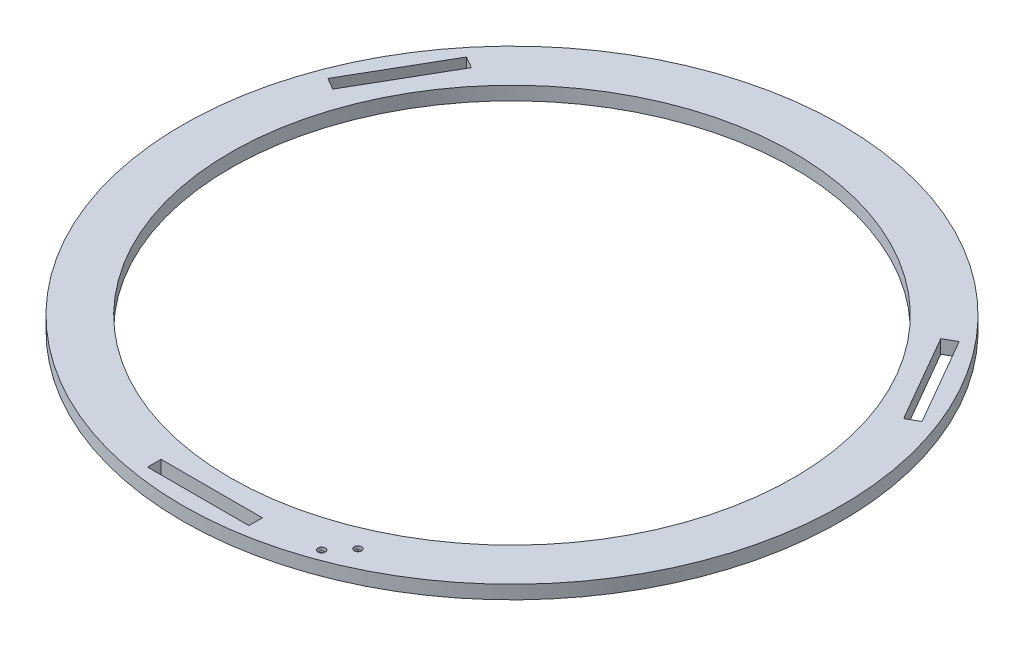
ISO-10303-21;
HEADER;
FILE_DESCRIPTION(('STEP AP214'),'2;1');
FILE_NAME('part.step','',(''),(''),'','','');
FILE_SCHEMA(('AUTOMOTIVE_DESIGN { 1 0 10303 214 1 1 1 1 }'));
ENDSEC;
DATA;
#1=APPLICATION_CONTEXT('core data for automotive mechanical design processes');
#2=APPLICATION_PROTOCOL_DEFINITION('international standard','automotive_design',2000,#1);
#3=PRODUCT_CONTEXT('',#1,'mechanical');
#4=PRODUCT('Part','Part','',(#3));
#5=PRODUCT_RELATED_PRODUCT_CATEGORY('part','',(#4));
#6=PRODUCT_DEFINITION_FORMATION('','',#4);
#7=PRODUCT_DEFINITION_CONTEXT('part definition',#1,'design');
#8=PRODUCT_DEFINITION('design','',#6,#7);
#9=PRODUCT_DEFINITION_SHAPE('','',#8);
#10=(LENGTH_UNIT() NAMED_UNIT(*) SI_UNIT(.MILLI.,.METRE.));
#11=(NAMED_UNIT(*) PLANE_ANGLE_UNIT() SI_UNIT($,.RADIAN.));
#12=(NAMED_UNIT(*) SI_UNIT($,.STERADIAN.) SOLID_ANGLE_UNIT());
#13=UNCERTAINTY_MEASURE_WITH_UNIT(LENGTH_MEASURE(1.E-05),#10,'distance_accuracy_value','');
#14=(GEOMETRIC_REPRESENTATION_CONTEXT(3) GLOBAL_UNCERTAINTY_ASSIGNED_CONTEXT((#13)) GLOBAL_UNIT_ASSIGNED_CONTEXT((#10,
#11,#12)) REPRESENTATION_CONTEXT('',''));
#15=CARTESIAN_POINT('',(0.,0.,0.));
#16=DIRECTION('',(0.,0.,1.));
#17=DIRECTION('',(1.,0.,0.));
#18=AXIS2_PLACEMENT_3D('',#15,#16,#17);
#19=CARTESIAN_POINT('',(0.,12.,0.));
#20=DIRECTION('',(0.,1.,0.));
#21=DIRECTION('',(0.,0.,1.));
#22=AXIS2_PLACEMENT_3D('',#19,#20,#21);
#23=PLANE('',#22);
#24=CARTESIAN_POINT('',(111.175516554323,12.,247.940494387325));
#25=DIRECTION('',(0.,1.,0.));
#26=DIRECTION('',(0.,0.,1.));
#27=AXIS2_PLACEMENT_3D('',#24,#25,#26);
#28=CIRCLE('',#27,3.25);
#29=CARTESIAN_POINT('',(111.175516554323,12.,251.190494387325));
#30=VERTEX_POINT('',#29);
#31=EDGE_CURVE('E256',#30,#30,#28,.T.);
#32=ORIENTED_EDGE('',*,*,#31,.F.);
#33=EDGE_LOOP('',(#32));
#34=FACE_BOUND('',#33,.T.);
#35=CARTESIAN_POINT('',(96.0819531740032,12.,265.039744209591));
#36=DIRECTION('',(0.,1.,0.));
#37=DIRECTION('',(0.,0.,1.));
#38=AXIS2_PLACEMENT_3D('',#35,#36,#37);
#39=CIRCLE('',#38,3.25);
#40=CARTESIAN_POINT('',(96.0819531740032,12.,268.289744209591));
#41=VERTEX_POINT('',#40);
#42=EDGE_CURVE('E260',#41,#41,#39,.T.);
#43=ORIENTED_EDGE('',*,*,#42,.F.);
#44=EDGE_LOOP('',(#43));
#45=FACE_BOUND('',#44,.T.);
#46=DIRECTION('',(-0.866025403784443,0.,-0.499999999999992));
#47=VECTOR('',#46,1.);
#48=CARTESIAN_POINT('',(-208.295770108554,12.,-172.221143170298));
#49=LINE('',#48,#47);
#50=CARTESIAN_POINT('',(-208.295770108554,12.,-172.221143170298));
#51=VERTEX_POINT('',#50);
#52=CARTESIAN_POINT('',(-218.688074953968,12.,-178.221143170298));
#53=VERTEX_POINT('',#52);
#54=EDGE_CURVE('E48',#51,#53,#49,.T.);
#55=ORIENTED_EDGE('',*,*,#54,.F.);
#56=DIRECTION('',(0.499999999999992,0.,-0.866025403784443));
#57=VECTOR('',#56,1.);
#58=CARTESIAN_POINT('',(-253.295770108554,12.,-94.2788568296979));
#59=LINE('',#58,#57);
#60=CARTESIAN_POINT('',(-253.295770108554,12.,-94.2788568296979));
#61=VERTEX_POINT('',#60);
#62=EDGE_CURVE('E140',#61,#51,#59,.T.);
#63=ORIENTED_EDGE('',*,*,#62,.F.);
#64=DIRECTION('',(0.866025403784443,0.,0.499999999999992));
#65=VECTOR('',#64,1.);
#66=CARTESIAN_POINT('',(-263.688074953967,12.,-100.278856829698));
#67=LINE('',#66,#65);
#68=CARTESIAN_POINT('',(-263.688074953967,12.,-100.278856829698));
#69=VERTEX_POINT('',#68);
#70=EDGE_CURVE('E143',#69,#61,#67,.T.);
#71=ORIENTED_EDGE('',*,*,#70,.F.);
#72=DIRECTION('',(-0.499999999999992,0.,0.866025403784443));
#73=VECTOR('',#72,1.);
#74=CARTESIAN_POINT('',(-218.688074953968,12.,-178.221143170298));
#75=LINE('',#74,#73);
#76=EDGE_CURVE('E152',#53,#69,#75,.T.);
#77=ORIENTED_EDGE('',*,*,#76,.F.);
#78=EDGE_LOOP('',(#55,#63,#71,#77));
#79=FACE_BOUND('',#78,.T.);
#80=DIRECTION('',(0.866025403784436,0.,-0.500000000000004));
#81=VECTOR('',#80,1.);
#82=CARTESIAN_POINT('',(253.295770108552,12.,-94.2788568297014));
#83=LINE('',#82,#81);
#84=CARTESIAN_POINT('',(253.295770108552,12.,-94.2788568297014));
#85=VERTEX_POINT('',#84);
#86=CARTESIAN_POINT('',(263.688074953966,12.,-100.278856829701));
#87=VERTEX_POINT('',#86);
#88=EDGE_CURVE('E158',#85,#87,#83,.T.);
#89=ORIENTED_EDGE('',*,*,#88,.F.);
#90=DIRECTION('',(0.500000000000004,0.,0.866025403784436));
#91=VECTOR('',#90,1.);
#92=CARTESIAN_POINT('',(208.295770108552,12.,-172.221143170301));
#93=LINE('',#92,#91);
#94=CARTESIAN_POINT('',(208.295770108552,12.,-172.221143170301));
#95=VERTEX_POINT('',#94);
#96=EDGE_CURVE('E166',#95,#85,#93,.T.);
#97=ORIENTED_EDGE('',*,*,#96,.F.);
#98=DIRECTION('',(-0.866025403784436,0.,0.500000000000004));
#99=VECTOR('',#98,1.);
#100=CARTESIAN_POINT('',(218.688074953965,12.,-178.221143170301));
#101=LINE('',#100,#99);
#102=CARTESIAN_POINT('',(218.688074953965,12.,-178.221143170301));
#103=VERTEX_POINT('',#102);
#104=EDGE_CURVE('E180',#103,#95,#101,.T.);
#105=ORIENTED_EDGE('',*,*,#104,.F.);
#106=DIRECTION('',(-0.500000000000004,0.,-0.866025403784436));
#107=VECTOR('',#106,1.);
#108=CARTESIAN_POINT('',(263.688074953966,12.,-100.278856829701));
#109=LINE('',#108,#107);
#110=EDGE_CURVE('E177',#87,#103,#109,.T.);
#111=ORIENTED_EDGE('',*,*,#110,.F.);
#112=EDGE_LOOP('',(#89,#97,#105,#111));
#113=FACE_BOUND('',#112,.T.);
#114=DIRECTION('',(0.,0.,1.));
#115=VECTOR('',#114,1.);
#116=CARTESIAN_POINT('',(-45.,12.,266.5));
#117=LINE('',#116,#115);
#118=CARTESIAN_POINT('',(-45.,12.,266.5));
#119=VERTEX_POINT('',#118);
#120=CARTESIAN_POINT('',(-45.,12.,278.5));
#121=VERTEX_POINT('',#120);
#122=EDGE_CURVE('E187',#119,#121,#117,.T.);
#123=ORIENTED_EDGE('',*,*,#122,.F.);
#124=DIRECTION('',(-1.,0.,0.));
#125=VECTOR('',#124,1.);
#126=CARTESIAN_POINT('',(45.,12.,266.5));
#127=LINE('',#126,#125);
#128=CARTESIAN_POINT('',(45.,12.,266.5));
#129=VERTEX_POINT('',#128);
#130=EDGE_CURVE('E198',#129,#119,#127,.T.);
#131=ORIENTED_EDGE('',*,*,#130,.F.);
#132=DIRECTION('',(0.,0.,-1.));
#133=VECTOR('',#132,1.);
#134=CARTESIAN_POINT('',(45.,12.,278.5));
#135=LINE('',#134,#133);
#136=CARTESIAN_POINT('',(45.,12.,278.5));
#137=VERTEX_POINT('',#136);
#138=EDGE_CURVE('E212',#137,#129,#135,.T.);
#139=ORIENTED_EDGE('',*,*,#138,.F.);
#140=DIRECTION('',(1.,0.,0.));
#141=VECTOR('',#140,1.);
#142=CARTESIAN_POINT('',(-45.,12.,278.5));
#143=LINE('',#142,#141);
#144=EDGE_CURVE('E209',#121,#137,#143,.T.);
#145=ORIENTED_EDGE('',*,*,#144,.F.);
#146=EDGE_LOOP('',(#123,#131,#139,#145));
#147=FACE_BOUND('',#146,.T.);
#148=CARTESIAN_POINT('',(0.,12.,0.));
#149=DIRECTION('',(0.,1.,0.));
#150=DIRECTION('',(0.,0.,1.));
#151=AXIS2_PLACEMENT_3D('',#148,#149,#150);
#152=CIRCLE('',#151,292.5);
#153=CARTESIAN_POINT('',(0.,12.,292.5));
#154=VERTEX_POINT('',#153);
#155=EDGE_CURVE('E11',#154,#154,#152,.T.);
#156=ORIENTED_EDGE('',*,*,#155,.T.);
#157=EDGE_LOOP('',(#156));
#158=FACE_BOUND('',#157,.T.);
#159=CARTESIAN_POINT('',(0.,12.,0.));
#160=DIRECTION('',(0.,1.,0.));
#161=DIRECTION('',(0.,0.,1.));
#162=AXIS2_PLACEMENT_3D('',#159,#160,#161);
#163=CIRCLE('',#162,250.);
#164=CARTESIAN_POINT('',(0.,12.,250.));
#165=VERTEX_POINT('',#164);
#166=EDGE_CURVE('E226',#165,#165,#163,.T.);
#167=ORIENTED_EDGE('',*,*,#166,.F.);
#168=EDGE_LOOP('',(#167));
#169=FACE_BOUND('',#168,.T.);
#170=ADVANCED_FACE('F33',(#34,#45,#79,#113,#147,#158,#169),#23,.T.);
#171=CARTESIAN_POINT('',(0.,0.,0.));
#172=DIRECTION('',(0.,1.,0.));
#173=DIRECTION('',(0.,0.,1.));
#174=AXIS2_PLACEMENT_3D('',#171,#172,#173);
#175=PLANE('',#174);
#176=CARTESIAN_POINT('',(111.175516554323,0.,247.940494387325));
#177=DIRECTION('',(0.,1.,0.));
#178=DIRECTION('',(0.,0.,1.));
#179=AXIS2_PLACEMENT_3D('',#176,#177,#178);
#180=CIRCLE('',#179,1.69999999999999);
#181=CARTESIAN_POINT('',(111.175516554323,0.,249.640494387325));
#182=VERTEX_POINT('',#181);
#183=EDGE_CURVE('E360',#182,#182,#180,.T.);
#184=ORIENTED_EDGE('',*,*,#183,.T.);
#185=EDGE_LOOP('',(#184));
#186=FACE_BOUND('',#185,.T.);
#187=CARTESIAN_POINT('',(96.0819531740032,0.,265.039744209591));
#188=DIRECTION('',(0.,1.,0.));
#189=DIRECTION('',(0.,0.,1.));
#190=AXIS2_PLACEMENT_3D('',#187,#188,#189);
#191=CIRCLE('',#190,1.69999999999999);
#192=CARTESIAN_POINT('',(96.0819531740032,0.,266.739744209591));
#193=VERTEX_POINT('',#192);
#194=EDGE_CURVE('E146',#193,#193,#191,.T.);
#195=ORIENTED_EDGE('',*,*,#194,.T.);
#196=EDGE_LOOP('',(#195));
#197=FACE_BOUND('',#196,.T.);
#198=DIRECTION('',(0.499999999999992,0.,-0.866025403784443));
#199=VECTOR('',#198,1.);
#200=CARTESIAN_POINT('',(-253.295770108554,0.,-94.2788568296979));
#201=LINE('',#200,#199);
#202=CARTESIAN_POINT('',(-253.295770108554,0.,-94.2788568296979));
#203=VERTEX_POINT('',#202);
#204=CARTESIAN_POINT('',(-208.295770108554,0.,-172.221143170298));
#205=VERTEX_POINT('',#204);
#206=EDGE_CURVE('E130',#203,#205,#201,.T.);
#207=ORIENTED_EDGE('',*,*,#206,.T.);
#208=DIRECTION('',(-0.866025403784443,0.,-0.499999999999992));
#209=VECTOR('',#208,1.);
#210=CARTESIAN_POINT('',(-208.295770108554,0.,-172.221143170298));
#211=LINE('',#210,#209);
#212=CARTESIAN_POINT('',(-218.688074953968,0.,-178.221143170298));
#213=VERTEX_POINT('',#212);
#214=EDGE_CURVE('E124',#205,#213,#211,.T.);
#215=ORIENTED_EDGE('',*,*,#214,.T.);
#216=DIRECTION('',(-0.499999999999992,0.,0.866025403784443));
#217=VECTOR('',#216,1.);
#218=CARTESIAN_POINT('',(-218.688074953968,0.,-178.221143170298));
#219=LINE('',#218,#217);
#220=CARTESIAN_POINT('',(-263.688074953967,0.,-100.278856829698));
#221=VERTEX_POINT('',#220);
#222=EDGE_CURVE('E133',#213,#221,#219,.T.);
#223=ORIENTED_EDGE('',*,*,#222,.T.);
#224=DIRECTION('',(0.866025403784443,0.,0.499999999999992));
#225=VECTOR('',#224,1.);
#226=CARTESIAN_POINT('',(-263.688074953967,0.,-100.278856829698));
#227=LINE('',#226,#225);
#228=EDGE_CURVE('E56',#221,#203,#227,.T.);
#229=ORIENTED_EDGE('',*,*,#228,.T.);
#230=EDGE_LOOP('',(#207,#215,#223,#229));
#231=FACE_BOUND('',#230,.T.);
#232=DIRECTION('',(0.500000000000004,0.,0.866025403784436));
#233=VECTOR('',#232,1.);
#234=CARTESIAN_POINT('',(208.295770108552,0.,-172.221143170301));
#235=LINE('',#234,#233);
#236=CARTESIAN_POINT('',(208.295770108552,0.,-172.221143170301));
#237=VERTEX_POINT('',#236);
#238=CARTESIAN_POINT('',(253.295770108552,0.,-94.2788568297014));
#239=VERTEX_POINT('',#238);
#240=EDGE_CURVE('E172',#237,#239,#235,.T.);
#241=ORIENTED_EDGE('',*,*,#240,.T.);
#242=DIRECTION('',(0.866025403784436,0.,-0.500000000000004));
#243=VECTOR('',#242,1.);
#244=CARTESIAN_POINT('',(253.295770108552,0.,-94.2788568297014));
#245=LINE('',#244,#243);
#246=CARTESIAN_POINT('',(263.688074953966,0.,-100.278856829701));
#247=VERTEX_POINT('',#246);
#248=EDGE_CURVE('E162',#239,#247,#245,.T.);
#249=ORIENTED_EDGE('',*,*,#248,.T.);
#250=DIRECTION('',(-0.500000000000004,0.,-0.866025403784436));
#251=VECTOR('',#250,1.);
#252=CARTESIAN_POINT('',(263.688074953966,0.,-100.278856829701));
#253=LINE('',#252,#251);
#254=CARTESIAN_POINT('',(218.688074953965,0.,-178.221143170301));
#255=VERTEX_POINT('',#254);
#256=EDGE_CURVE('E165',#247,#255,#253,.T.);
#257=ORIENTED_EDGE('',*,*,#256,.T.);
#258=DIRECTION('',(-0.866025403784436,0.,0.500000000000004));
#259=VECTOR('',#258,1.);
#260=CARTESIAN_POINT('',(218.688074953965,0.,-178.221143170301));
#261=LINE('',#260,#259);
#262=EDGE_CURVE('E169',#255,#237,#261,.T.);
#263=ORIENTED_EDGE('',*,*,#262,.T.);
#264=EDGE_LOOP('',(#241,#249,#257,#263));
#265=FACE_BOUND('',#264,.T.);
#266=DIRECTION('',(-1.,0.,0.));
#267=VECTOR('',#266,1.);
#268=CARTESIAN_POINT('',(45.,0.,266.5));
#269=LINE('',#268,#267);
#270=CARTESIAN_POINT('',(45.,0.,266.5));
#271=VERTEX_POINT('',#270);
#272=CARTESIAN_POINT('',(-45.,0.,266.5));
#273=VERTEX_POINT('',#272);
#274=EDGE_CURVE('E204',#271,#273,#269,.T.);
#275=ORIENTED_EDGE('',*,*,#274,.T.);
#276=DIRECTION('',(0.,0.,1.));
#277=VECTOR('',#276,1.);
#278=CARTESIAN_POINT('',(-45.,0.,266.5));
#279=LINE('',#278,#277);
#280=CARTESIAN_POINT('',(-45.,0.,278.5));
#281=VERTEX_POINT('',#280);
#282=EDGE_CURVE('E194',#273,#281,#279,.T.);
#283=ORIENTED_EDGE('',*,*,#282,.T.);
#284=DIRECTION('',(1.,0.,0.));
#285=VECTOR('',#284,1.);
#286=CARTESIAN_POINT('',(-45.,0.,278.5));
#287=LINE('',#286,#285);
#288=CARTESIAN_POINT('',(45.,0.,278.5));
#289=VERTEX_POINT('',#288);
#290=EDGE_CURVE('E197',#281,#289,#287,.T.);
#291=ORIENTED_EDGE('',*,*,#290,.T.);
#292=DIRECTION('',(0.,0.,-1.));
#293=VECTOR('',#292,1.);
#294=CARTESIAN_POINT('',(45.,0.,278.5));
#295=LINE('',#294,#293);
#296=EDGE_CURVE('E201',#289,#271,#295,.T.);
#297=ORIENTED_EDGE('',*,*,#296,.T.);
#298=EDGE_LOOP('',(#275,#283,#291,#297));
#299=FACE_BOUND('',#298,.T.);
#300=CARTESIAN_POINT('',(0.,0.,0.));
#301=DIRECTION('',(0.,1.,0.));
#302=DIRECTION('',(0.,0.,1.));
#303=AXIS2_PLACEMENT_3D('',#300,#301,#302);
#304=CIRCLE('',#303,292.5);
#305=CARTESIAN_POINT('',(0.,0.,292.5));
#306=VERTEX_POINT('',#305);
#307=EDGE_CURVE('E37',#306,#306,#304,.T.);
#308=ORIENTED_EDGE('',*,*,#307,.F.);
#309=EDGE_LOOP('',(#308));
#310=FACE_BOUND('',#309,.T.);
#311=CARTESIAN_POINT('',(0.,0.,0.));
#312=DIRECTION('',(0.,1.,0.));
#313=DIRECTION('',(0.,0.,1.));
#314=AXIS2_PLACEMENT_3D('',#311,#312,#313);
#315=CIRCLE('',#314,250.);
#316=CARTESIAN_POINT('',(0.,0.,250.));
#317=VERTEX_POINT('',#316);
#318=EDGE_CURVE('E219',#317,#317,#315,.T.);
#319=ORIENTED_EDGE('',*,*,#318,.T.);
#320=EDGE_LOOP('',(#319));
#321=FACE_BOUND('',#320,.T.);
#322=ADVANCED_FACE('F137',(#186,#197,#231,#265,#299,#310,#321),#175,.F.);
#323=CARTESIAN_POINT('',(0.,12.,0.));
#324=DIRECTION('',(0.,-1.,0.));
#325=DIRECTION('',(0.,0.,-1.));
#326=AXIS2_PLACEMENT_3D('',#323,#324,#325);
#327=CYLINDRICAL_SURFACE('',#326,292.5);
#328=ORIENTED_EDGE('',*,*,#155,.F.);
#329=EDGE_LOOP('',(#328));
#330=FACE_BOUND('',#329,.T.);
#331=ORIENTED_EDGE('',*,*,#307,.T.);
#332=EDGE_LOOP('',(#331));
#333=FACE_BOUND('',#332,.T.);
#334=ADVANCED_FACE('F35',(#330,#333),#327,.T.);
#335=CARTESIAN_POINT('',(0.,12.,0.));
#336=DIRECTION('',(0.,-1.,0.));
#337=DIRECTION('',(0.,0.,-1.));
#338=AXIS2_PLACEMENT_3D('',#335,#336,#337);
#339=CYLINDRICAL_SURFACE('',#338,250.);
#340=ORIENTED_EDGE('',*,*,#166,.T.);
#341=EDGE_LOOP('',(#340));
#342=FACE_BOUND('',#341,.T.);
#343=ORIENTED_EDGE('',*,*,#318,.F.);
#344=EDGE_LOOP('',(#343));
#345=FACE_BOUND('',#344,.T.);
#346=ADVANCED_FACE('F233',(#342,#345),#339,.F.);
#347=CARTESIAN_POINT('',(-45.,0.,266.5));
#348=DIRECTION('',(-1.,0.,0.));
#349=DIRECTION('',(0.,0.,1.));
#350=AXIS2_PLACEMENT_3D('',#347,#348,#349);
#351=PLANE('',#350);
#352=ORIENTED_EDGE('',*,*,#122,.T.);
#353=DIRECTION('',(0.,1.,0.));
#354=VECTOR('',#353,1.);
#355=CARTESIAN_POINT('',(-45.,0.,278.5));
#356=LINE('',#355,#354);
#357=EDGE_CURVE('E207',#281,#121,#356,.T.);
#358=ORIENTED_EDGE('',*,*,#357,.F.);
#359=ORIENTED_EDGE('',*,*,#282,.F.);
#360=DIRECTION('',(0.,1.,0.));
#361=VECTOR('',#360,1.);
#362=CARTESIAN_POINT('',(-45.,0.,266.5));
#363=LINE('',#362,#361);
#364=EDGE_CURVE('E217',#273,#119,#363,.T.);
#365=ORIENTED_EDGE('',*,*,#364,.T.);
#366=EDGE_LOOP('',(#352,#358,#359,#365));
#367=FACE_BOUND('',#366,.T.);
#368=ADVANCED_FACE('F235',(#367),#351,.F.);
#369=CARTESIAN_POINT('',(45.,0.,266.5));
#370=DIRECTION('',(0.,0.,-1.));
#371=DIRECTION('',(-1.,0.,0.));
#372=AXIS2_PLACEMENT_3D('',#369,#370,#371);
#373=PLANE('',#372);
#374=ORIENTED_EDGE('',*,*,#130,.T.);
#375=ORIENTED_EDGE('',*,*,#364,.F.);
#376=ORIENTED_EDGE('',*,*,#274,.F.);
#377=DIRECTION('',(0.,1.,0.));
#378=VECTOR('',#377,1.);
#379=CARTESIAN_POINT('',(45.,0.,266.5));
#380=LINE('',#379,#378);
#381=EDGE_CURVE('E220',#271,#129,#380,.T.);
#382=ORIENTED_EDGE('',*,*,#381,.T.);
#383=EDGE_LOOP('',(#374,#375,#376,#382));
#384=FACE_BOUND('',#383,.T.);
#385=ADVANCED_FACE('F242',(#384),#373,.F.);
#386=CARTESIAN_POINT('',(45.,0.,278.5));
#387=DIRECTION('',(1.,0.,0.));
#388=DIRECTION('',(0.,0.,-1.));
#389=AXIS2_PLACEMENT_3D('',#386,#387,#388);
#390=PLANE('',#389);
#391=ORIENTED_EDGE('',*,*,#138,.T.);
#392=ORIENTED_EDGE('',*,*,#381,.F.);
#393=ORIENTED_EDGE('',*,*,#296,.F.);
#394=DIRECTION('',(0.,1.,0.));
#395=VECTOR('',#394,1.);
#396=CARTESIAN_POINT('',(45.,0.,278.5));
#397=LINE('',#396,#395);
#398=EDGE_CURVE('E222',#289,#137,#397,.T.);
#399=ORIENTED_EDGE('',*,*,#398,.T.);
#400=EDGE_LOOP('',(#391,#392,#393,#399));
#401=FACE_BOUND('',#400,.T.);
#402=ADVANCED_FACE('F288',(#401),#390,.F.);
#403=CARTESIAN_POINT('',(-45.,0.,278.5));
#404=DIRECTION('',(0.,0.,1.));
#405=DIRECTION('',(1.,0.,0.));
#406=AXIS2_PLACEMENT_3D('',#403,#404,#405);
#407=PLANE('',#406);
#408=ORIENTED_EDGE('',*,*,#144,.T.);
#409=ORIENTED_EDGE('',*,*,#398,.F.);
#410=ORIENTED_EDGE('',*,*,#290,.F.);
#411=ORIENTED_EDGE('',*,*,#357,.T.);
#412=EDGE_LOOP('',(#408,#409,#410,#411));
#413=FACE_BOUND('',#412,.T.);
#414=ADVANCED_FACE('F282',(#413),#407,.F.);
#415=CARTESIAN_POINT('',(253.295770108552,0.,-94.2788568297014));
#416=DIRECTION('',(0.500000000000004,0.,0.866025403784436));
#417=DIRECTION('',(0.866025403784436,0.,-0.500000000000004));
#418=AXIS2_PLACEMENT_3D('',#415,#416,#417);
#419=PLANE('',#418);
#420=ORIENTED_EDGE('',*,*,#88,.T.);
#421=DIRECTION('',(0.,1.,0.));
#422=VECTOR('',#421,1.);
#423=CARTESIAN_POINT('',(263.688074953966,0.,-100.278856829701));
#424=LINE('',#423,#422);
#425=EDGE_CURVE('E175',#247,#87,#424,.T.);
#426=ORIENTED_EDGE('',*,*,#425,.F.);
#427=ORIENTED_EDGE('',*,*,#248,.F.);
#428=DIRECTION('',(0.,1.,0.));
#429=VECTOR('',#428,1.);
#430=CARTESIAN_POINT('',(253.295770108552,0.,-94.2788568297014));
#431=LINE('',#430,#429);
#432=EDGE_CURVE('E185',#239,#85,#431,.T.);
#433=ORIENTED_EDGE('',*,*,#432,.T.);
#434=EDGE_LOOP('',(#420,#426,#427,#433));
#435=FACE_BOUND('',#434,.T.);
#436=ADVANCED_FACE('F295',(#435),#419,.F.);
#437=CARTESIAN_POINT('',(208.295770108552,0.,-172.221143170301));
#438=DIRECTION('',(-0.866025403784436,0.,0.500000000000004));
#439=DIRECTION('',(0.500000000000004,0.,0.866025403784436));
#440=AXIS2_PLACEMENT_3D('',#437,#438,#439);
#441=PLANE('',#440);
#442=ORIENTED_EDGE('',*,*,#96,.T.);
#443=ORIENTED_EDGE('',*,*,#432,.F.);
#444=ORIENTED_EDGE('',*,*,#240,.F.);
#445=DIRECTION('',(0.,1.,0.));
#446=VECTOR('',#445,1.);
#447=CARTESIAN_POINT('',(208.295770108552,0.,-172.221143170301));
#448=LINE('',#447,#446);
#449=EDGE_CURVE('E188',#237,#95,#448,.T.);
#450=ORIENTED_EDGE('',*,*,#449,.T.);
#451=EDGE_LOOP('',(#442,#443,#444,#450));
#452=FACE_BOUND('',#451,.T.);
#453=ADVANCED_FACE('F301',(#452),#441,.F.);
#454=CARTESIAN_POINT('',(218.688074953965,0.,-178.221143170301));
#455=DIRECTION('',(-0.500000000000004,0.,-0.866025403784436));
#456=DIRECTION('',(-0.866025403784436,0.,0.500000000000004));
#457=AXIS2_PLACEMENT_3D('',#454,#455,#456);
#458=PLANE('',#457);
#459=ORIENTED_EDGE('',*,*,#104,.T.);
#460=ORIENTED_EDGE('',*,*,#449,.F.);
#461=ORIENTED_EDGE('',*,*,#262,.F.);
#462=DIRECTION('',(0.,1.,0.));
#463=VECTOR('',#462,1.);
#464=CARTESIAN_POINT('',(218.688074953965,0.,-178.221143170301));
#465=LINE('',#464,#463);
#466=EDGE_CURVE('E190',#255,#103,#465,.T.);
#467=ORIENTED_EDGE('',*,*,#466,.T.);
#468=EDGE_LOOP('',(#459,#460,#461,#467));
#469=FACE_BOUND('',#468,.T.);
#470=ADVANCED_FACE('F306',(#469),#458,.F.);
#471=CARTESIAN_POINT('',(263.688074953966,0.,-100.278856829701));
#472=DIRECTION('',(0.866025403784436,0.,-0.500000000000004));
#473=DIRECTION('',(-0.500000000000004,0.,-0.866025403784436));
#474=AXIS2_PLACEMENT_3D('',#471,#472,#473);
#475=PLANE('',#474);
#476=ORIENTED_EDGE('',*,*,#110,.T.);
#477=ORIENTED_EDGE('',*,*,#466,.F.);
#478=ORIENTED_EDGE('',*,*,#256,.F.);
#479=ORIENTED_EDGE('',*,*,#425,.T.);
#480=EDGE_LOOP('',(#476,#477,#478,#479));
#481=FACE_BOUND('',#480,.T.);
#482=ADVANCED_FACE('F303',(#481),#475,.F.);
#483=CARTESIAN_POINT('',(-208.295770108554,0.,-172.221143170298));
#484=DIRECTION('',(0.499999999999992,0.,-0.866025403784443));
#485=DIRECTION('',(-0.866025403784443,0.,-0.499999999999992));
#486=AXIS2_PLACEMENT_3D('',#483,#484,#485);
#487=PLANE('',#486);
#488=ORIENTED_EDGE('',*,*,#54,.T.);
#489=DIRECTION('',(0.,1.,0.));
#490=VECTOR('',#489,1.);
#491=CARTESIAN_POINT('',(-218.688074953968,0.,-178.221143170298));
#492=LINE('',#491,#490);
#493=EDGE_CURVE('E120',#213,#53,#492,.T.);
#494=ORIENTED_EDGE('',*,*,#493,.F.);
#495=ORIENTED_EDGE('',*,*,#214,.F.);
#496=DIRECTION('',(0.,1.,0.));
#497=VECTOR('',#496,1.);
#498=CARTESIAN_POINT('',(-208.295770108554,0.,-172.221143170298));
#499=LINE('',#498,#497);
#500=EDGE_CURVE('E156',#205,#51,#499,.T.);
#501=ORIENTED_EDGE('',*,*,#500,.T.);
#502=EDGE_LOOP('',(#488,#494,#495,#501));
#503=FACE_BOUND('',#502,.T.);
#504=ADVANCED_FACE('F122',(#503),#487,.F.);
#505=CARTESIAN_POINT('',(-253.295770108554,0.,-94.2788568296979));
#506=DIRECTION('',(0.866025403784443,0.,0.499999999999992));
#507=DIRECTION('',(0.499999999999992,0.,-0.866025403784443));
#508=AXIS2_PLACEMENT_3D('',#505,#506,#507);
#509=PLANE('',#508);
#510=ORIENTED_EDGE('',*,*,#62,.T.);
#511=ORIENTED_EDGE('',*,*,#500,.F.);
#512=ORIENTED_EDGE('',*,*,#206,.F.);
#513=DIRECTION('',(0.,1.,0.));
#514=VECTOR('',#513,1.);
#515=CARTESIAN_POINT('',(-253.295770108554,0.,-94.2788568296979));
#516=LINE('',#515,#514);
#517=EDGE_CURVE('E159',#203,#61,#516,.T.);
#518=ORIENTED_EDGE('',*,*,#517,.T.);
#519=EDGE_LOOP('',(#510,#511,#512,#518));
#520=FACE_BOUND('',#519,.T.);
#521=ADVANCED_FACE('F316',(#520),#509,.F.);
#522=CARTESIAN_POINT('',(-263.688074953967,0.,-100.278856829698));
#523=DIRECTION('',(-0.499999999999992,0.,0.866025403784443));
#524=DIRECTION('',(0.866025403784443,0.,0.499999999999992));
#525=AXIS2_PLACEMENT_3D('',#522,#523,#524);
#526=PLANE('',#525);
#527=ORIENTED_EDGE('',*,*,#70,.T.);
#528=ORIENTED_EDGE('',*,*,#517,.F.);
#529=ORIENTED_EDGE('',*,*,#228,.F.);
#530=DIRECTION('',(0.,1.,0.));
#531=VECTOR('',#530,1.);
#532=CARTESIAN_POINT('',(-263.688074953967,0.,-100.278856829698));
#533=LINE('',#532,#531);
#534=EDGE_CURVE('E129',#221,#69,#533,.T.);
#535=ORIENTED_EDGE('',*,*,#534,.T.);
#536=EDGE_LOOP('',(#527,#528,#529,#535));
#537=FACE_BOUND('',#536,.T.);
#538=ADVANCED_FACE('F320',(#537),#526,.F.);
#539=CARTESIAN_POINT('',(-218.688074953968,0.,-178.221143170298));
#540=DIRECTION('',(-0.866025403784443,0.,-0.499999999999992));
#541=DIRECTION('',(-0.499999999999992,0.,0.866025403784443));
#542=AXIS2_PLACEMENT_3D('',#539,#540,#541);
#543=PLANE('',#542);
#544=ORIENTED_EDGE('',*,*,#76,.T.);
#545=ORIENTED_EDGE('',*,*,#534,.F.);
#546=ORIENTED_EDGE('',*,*,#222,.F.);
#547=ORIENTED_EDGE('',*,*,#493,.T.);
#548=EDGE_LOOP('',(#544,#545,#546,#547));
#549=FACE_BOUND('',#548,.T.);
#550=ADVANCED_FACE('F134',(#549),#543,.F.);
#551=CARTESIAN_POINT('',(96.0819531740032,12.,265.039744209591));
#552=DIRECTION('',(0.,1.,0.));
#553=DIRECTION('',(0.,0.,1.));
#554=AXIS2_PLACEMENT_3D('',#551,#552,#553);
#555=CYLINDRICAL_SURFACE('',#554,1.7);
#556=ORIENTED_EDGE('',*,*,#194,.F.);
#557=EDGE_LOOP('',(#556));
#558=FACE_BOUND('',#557,.T.);
#559=CARTESIAN_POINT('',(96.0819531740032,9.,265.039744209591));
#560=DIRECTION('',(0.,1.,0.));
#561=DIRECTION('',(0.,0.,1.));
#562=AXIS2_PLACEMENT_3D('',#559,#560,#561);
#563=CIRCLE('',#562,1.70000000000001);
#564=CARTESIAN_POINT('',(96.0819531740032,9.,266.739744209591));
#565=VERTEX_POINT('',#564);
#566=EDGE_CURVE('E366',#565,#565,#563,.T.);
#567=ORIENTED_EDGE('',*,*,#566,.T.);
#568=EDGE_LOOP('',(#567));
#569=FACE_BOUND('',#568,.T.);
#570=ADVANCED_FACE('F319',(#558,#569),#555,.F.);
#571=CARTESIAN_POINT('',(97.7819531740032,9.,265.039744209591));
#572=DIRECTION('',(0.,-1.,0.));
#573=DIRECTION('',(0.,0.,-1.));
#574=AXIS2_PLACEMENT_3D('',#571,#572,#573);
#575=PLANE('',#574);
#576=ORIENTED_EDGE('',*,*,#566,.F.);
#577=EDGE_LOOP('',(#576));
#578=FACE_BOUND('',#577,.T.);
#579=CARTESIAN_POINT('',(96.0819531740032,9.,265.039744209591));
#580=DIRECTION('',(0.,1.,0.));
#581=DIRECTION('',(0.,0.,1.));
#582=AXIS2_PLACEMENT_3D('',#579,#580,#581);
#583=CIRCLE('',#582,3.25);
#584=CARTESIAN_POINT('',(96.0819531740032,9.,268.289744209591));
#585=VERTEX_POINT('',#584);
#586=EDGE_CURVE('E364',#585,#585,#583,.T.);
#587=ORIENTED_EDGE('',*,*,#586,.T.);
#588=EDGE_LOOP('',(#587));
#589=FACE_BOUND('',#588,.T.);
#590=ADVANCED_FACE('F328',(#578,#589),#575,.F.);
#591=CARTESIAN_POINT('',(96.0819531740032,12.,265.039744209591));
#592=DIRECTION('',(0.,1.,0.));
#593=DIRECTION('',(0.,0.,1.));
#594=AXIS2_PLACEMENT_3D('',#591,#592,#593);
#595=CYLINDRICAL_SURFACE('',#594,3.25);
#596=ORIENTED_EDGE('',*,*,#586,.F.);
#597=EDGE_LOOP('',(#596));
#598=FACE_BOUND('',#597,.T.);
#599=ORIENTED_EDGE('',*,*,#42,.T.);
#600=EDGE_LOOP('',(#599));
#601=FACE_BOUND('',#600,.T.);
#602=ADVANCED_FACE('F332',(#598,#601),#595,.F.);
#603=CARTESIAN_POINT('',(111.175516554323,12.,247.940494387325));
#604=DIRECTION('',(0.,1.,0.));
#605=DIRECTION('',(0.,0.,1.));
#606=AXIS2_PLACEMENT_3D('',#603,#604,#605);
#607=CYLINDRICAL_SURFACE('',#606,1.7);
#608=ORIENTED_EDGE('',*,*,#183,.F.);
#609=EDGE_LOOP('',(#608));
#610=FACE_BOUND('',#609,.T.);
#611=CARTESIAN_POINT('',(111.175516554323,9.,247.940494387325));
#612=DIRECTION('',(0.,1.,0.));
#613=DIRECTION('',(0.,0.,1.));
#614=AXIS2_PLACEMENT_3D('',#611,#612,#613);
#615=CIRCLE('',#614,1.70000000000001);
#616=CARTESIAN_POINT('',(111.175516554323,9.,249.640494387325));
#617=VERTEX_POINT('',#616);
#618=EDGE_CURVE('E355',#617,#617,#615,.T.);
#619=ORIENTED_EDGE('',*,*,#618,.T.);
#620=EDGE_LOOP('',(#619));
#621=FACE_BOUND('',#620,.T.);
#622=ADVANCED_FACE('F336',(#610,#621),#607,.F.);
#623=CARTESIAN_POINT('',(112.875516554323,9.,247.940494387325));
#624=DIRECTION('',(0.,-1.,0.));
#625=DIRECTION('',(0.,0.,-1.));
#626=AXIS2_PLACEMENT_3D('',#623,#624,#625);
#627=PLANE('',#626);
#628=ORIENTED_EDGE('',*,*,#618,.F.);
#629=EDGE_LOOP('',(#628));
#630=FACE_BOUND('',#629,.T.);
#631=CARTESIAN_POINT('',(111.175516554323,9.,247.940494387325));
#632=DIRECTION('',(0.,1.,0.));
#633=DIRECTION('',(0.,0.,1.));
#634=AXIS2_PLACEMENT_3D('',#631,#632,#633);
#635=CIRCLE('',#634,3.25);
#636=CARTESIAN_POINT('',(111.175516554323,9.,251.190494387325));
#637=VERTEX_POINT('',#636);
#638=EDGE_CURVE('E353',#637,#637,#635,.T.);
#639=ORIENTED_EDGE('',*,*,#638,.T.);
#640=EDGE_LOOP('',(#639));
#641=FACE_BOUND('',#640,.T.);
#642=ADVANCED_FACE('F340',(#630,#641),#627,.F.);
#643=CARTESIAN_POINT('',(111.175516554323,12.,247.940494387325));
#644=DIRECTION('',(0.,1.,0.));
#645=DIRECTION('',(0.,0.,1.));
#646=AXIS2_PLACEMENT_3D('',#643,#644,#645);
#647=CYLINDRICAL_SURFACE('',#646,3.25);
#648=ORIENTED_EDGE('',*,*,#638,.F.);
#649=EDGE_LOOP('',(#648));
#650=FACE_BOUND('',#649,.T.);
#651=ORIENTED_EDGE('',*,*,#31,.T.);
#652=EDGE_LOOP('',(#651));
#653=FACE_BOUND('',#652,.T.);
#654=ADVANCED_FACE('F344',(#650,#653),#647,.F.);
#655=CLOSED_SHELL('',(#170,#322,#334,#346,#368,#385,#402,#414,#436,#453,#470,#482,#504,#521,
#538,#550,#570,#590,#602,#622,#642,#654));
#656=MANIFOLD_SOLID_BREP('B2',#655);
#657=ADVANCED_BREP_SHAPE_REPRESENTATION('',(#18,#656),#14);
#658=SHAPE_DEFINITION_REPRESENTATION(#9,#657);
ENDSEC;
END-ISO-10303-21;
